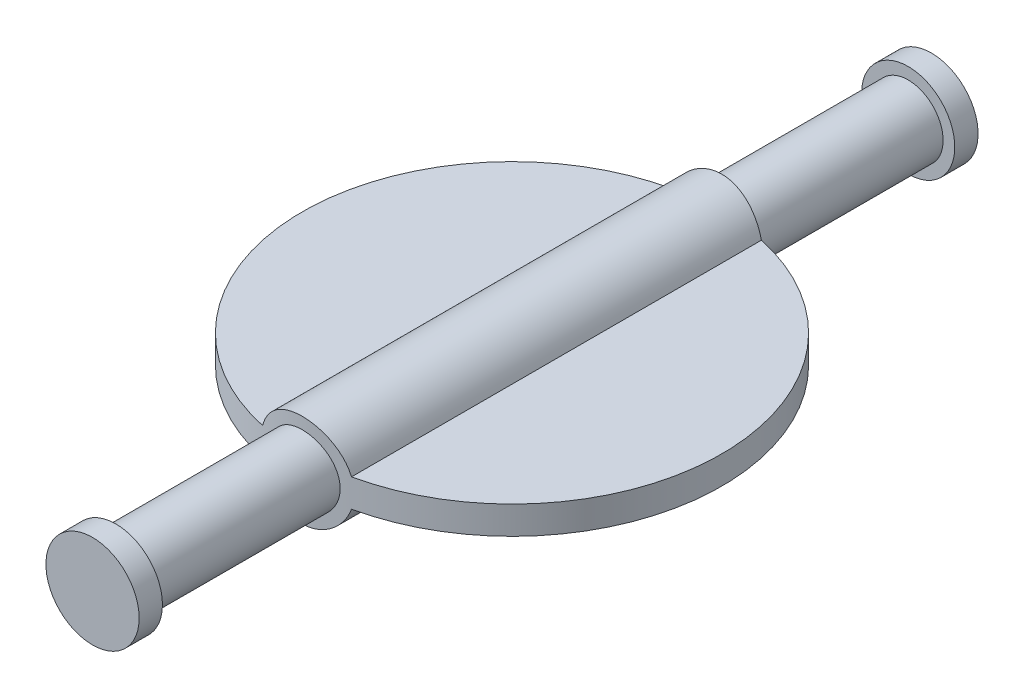
ISO-10303-21;
HEADER;
FILE_DESCRIPTION(('STEP AP214'),'2;1');
FILE_NAME('part.step','',(''),(''),'','','');
FILE_SCHEMA(('AUTOMOTIVE_DESIGN { 1 0 10303 214 1 1 1 1 }'));
ENDSEC;
DATA;
#1=APPLICATION_CONTEXT('core data for automotive mechanical design processes');
#2=APPLICATION_PROTOCOL_DEFINITION('international standard','automotive_design',2000,#1);
#3=PRODUCT_CONTEXT('',#1,'mechanical');
#4=PRODUCT('Part','Part','',(#3));
#5=PRODUCT_RELATED_PRODUCT_CATEGORY('part','',(#4));
#6=PRODUCT_DEFINITION_FORMATION('','',#4);
#7=PRODUCT_DEFINITION_CONTEXT('part definition',#1,'design');
#8=PRODUCT_DEFINITION('design','',#6,#7);
#9=PRODUCT_DEFINITION_SHAPE('','',#8);
#10=(LENGTH_UNIT() NAMED_UNIT(*) SI_UNIT(.MILLI.,.METRE.));
#11=(NAMED_UNIT(*) PLANE_ANGLE_UNIT() SI_UNIT($,.RADIAN.));
#12=(NAMED_UNIT(*) SI_UNIT($,.STERADIAN.) SOLID_ANGLE_UNIT());
#13=UNCERTAINTY_MEASURE_WITH_UNIT(LENGTH_MEASURE(1.E-05),#10,'distance_accuracy_value','');
#14=(GEOMETRIC_REPRESENTATION_CONTEXT(3) GLOBAL_UNCERTAINTY_ASSIGNED_CONTEXT((#13)) GLOBAL_UNIT_ASSIGNED_CONTEXT((#10,
#11,#12)) REPRESENTATION_CONTEXT('',''));
#15=CARTESIAN_POINT('',(0.,0.,0.));
#16=DIRECTION('',(0.,0.,1.));
#17=DIRECTION('',(1.,0.,0.));
#18=AXIS2_PLACEMENT_3D('',#15,#16,#17);
#19=CARTESIAN_POINT('',(0.,0.,36.));
#20=DIRECTION('',(0.,0.,-1.));
#21=DIRECTION('',(-1.,0.,0.));
#22=AXIS2_PLACEMENT_3D('',#19,#20,#21);
#23=CYLINDRICAL_SURFACE('',#22,1.5);
#24=CARTESIAN_POINT('',(0.,0.,35.));
#25=DIRECTION('',(0.,0.,1.));
#26=DIRECTION('',(1.,0.,0.));
#27=AXIS2_PLACEMENT_3D('',#24,#25,#26);
#28=CIRCLE('',#27,1.5);
#29=CARTESIAN_POINT('',(1.5,0.,35.));
#30=VERTEX_POINT('',#29);
#31=EDGE_CURVE('E111',#30,#30,#28,.T.);
#32=ORIENTED_EDGE('',*,*,#31,.F.);
#33=EDGE_LOOP('',(#32));
#34=FACE_BOUND('',#33,.T.);
#35=CARTESIAN_POINT('',(-1.5,0.,26.8741196746494));
#36=CARTESIAN_POINT('',(-1.4999966390526,-0.0836254488876177,26.8741211844077));
#37=CARTESIAN_POINT('',(-1.49298310142239,-0.167296563614922,26.8753145552884));
#38=CARTESIAN_POINT('',(-1.46512645684523,-0.332291125932099,26.8799547442091));
#39=CARTESIAN_POINT('',(-1.44427059618579,-0.413612336249714,26.8834036403486));
#40=CARTESIAN_POINT('',(-1.38937772620028,-0.571495370014066,26.8921536559339));
#41=CARTESIAN_POINT('',(-1.35535173295865,-0.648061109199787,26.8974532270317));
#42=CARTESIAN_POINT('',(-1.27511189813422,-0.794388572828226,26.909305632686));
#43=CARTESIAN_POINT('',(-1.22889942810094,-0.864151061745743,26.9158583261848));
#44=CARTESIAN_POINT('',(-1.12511251617978,-0.9955877098474,26.9295508269157));
#45=CARTESIAN_POINT('',(-1.06744142935936,-1.05718507883191,26.9366953039624));
#46=CARTESIAN_POINT('',(-0.942583202817203,-1.16987598411691,26.9507248840167));
#47=CARTESIAN_POINT('',(-0.875395499489993,-1.2209688978692,26.9576099716318));
#48=CARTESIAN_POINT('',(-0.732913721969003,-1.31148874033161,26.9703944218948));
#49=CARTESIAN_POINT('',(-0.657573648874022,-1.3508442046391,26.9762876545937));
#50=CARTESIAN_POINT('',(-0.501237373034323,-1.41631264231832,26.9863724217429));
#51=CARTESIAN_POINT('',(-0.420241538446913,-1.44242647673092,26.990564066836));
#52=CARTESIAN_POINT('',(-0.255686235806544,-1.48043552099034,26.9967404083463));
#53=CARTESIAN_POINT('',(-0.172157332007562,-1.49245974960282,26.9987451186654));
#54=CARTESIAN_POINT('',(-0.00424517131547821,-1.50234945249156,27.0003904760567));
#55=CARTESIAN_POINT('',(0.0801380271173393,-1.50021588914834,27.0000312838158));
#56=CARTESIAN_POINT('',(0.246481311047326,-1.48195118908307,26.9970051505883));
#57=CARTESIAN_POINT('',(0.328457118420085,-1.46595890195451,26.9943611021544));
#58=CARTESIAN_POINT('',(0.488545187767075,-1.4206493554521,26.9870878726298));
#59=CARTESIAN_POINT('',(0.566657331990903,-1.3913316902463,26.9824586310793));
#60=CARTESIAN_POINT('',(0.717213688669589,-1.32006561581081,26.9716961910717));
#61=CARTESIAN_POINT('',(0.789630313811427,-1.27805999275054,26.9655562039613));
#62=CARTESIAN_POINT('',(0.926439317907985,-1.18265230641897,26.952454428429));
#63=CARTESIAN_POINT('',(0.990831046749526,-1.12924932077351,26.9454925735148));
#64=CARTESIAN_POINT('',(1.110582764068,-1.01179271602842,26.9314216093956));
#65=CARTESIAN_POINT('',(1.16582370135192,-0.94761774305941,26.9243117383863));
#66=CARTESIAN_POINT('',(1.26477275306884,-0.810847745870508,26.9108277587088));
#67=CARTESIAN_POINT('',(1.30848076111945,-0.738252643990308,26.9044536568279));
#68=CARTESIAN_POINT('',(1.38314666069297,-0.586565014873512,26.8931625273709));
#69=CARTESIAN_POINT('',(1.41409021636755,-0.507465301144745,26.8882471398156));
#70=CARTESIAN_POINT('',(1.46221792248937,-0.345090556615473,26.8804571321393));
#71=CARTESIAN_POINT('',(1.47940328446077,-0.261815894140545,26.8775823323299));
#72=CARTESIAN_POINT('',(1.49935913092756,-0.094520306302721,26.8742337565327));
#73=CARTESIAN_POINT('',(1.50229932474746,-0.0105201721787389,26.873731714552));
#74=CARTESIAN_POINT('',(1.49413362160947,0.156772003014492,26.8751102086942));
#75=CARTESIAN_POINT('',(1.4830282671748,0.240064071308383,26.8769906527911));
#76=CARTESIAN_POINT('',(1.44723140095686,0.403036655514515,26.8828961247301));
#77=CARTESIAN_POINT('',(1.42262627438783,0.482736683926807,26.8869075115101));
#78=CARTESIAN_POINT('',(1.36061891411536,0.636882099767692,26.896611438033));
#79=CARTESIAN_POINT('',(1.32321591486056,0.711327172530541,26.9023040783435));
#80=CARTESIAN_POINT('',(1.23627400393754,0.853604756643666,26.9147947703844));
#81=CARTESIAN_POINT('',(1.18662633849562,0.921369943653635,26.9216025336021));
#82=CARTESIAN_POINT('',(1.07675367942479,1.047668119617,26.9355280000792));
#83=CARTESIAN_POINT('',(1.01652794183043,1.10620045866584,26.942645725112));
#84=CARTESIAN_POINT('',(0.886456842197285,1.21299113563722,26.9564785327096));
#85=CARTESIAN_POINT('',(0.816517952031717,1.26113629577073,26.963188658068));
#86=CARTESIAN_POINT('',(0.669446068769595,1.34499319620293,26.9753706745976));
#87=CARTESIAN_POINT('',(0.592313308482376,1.38070533868431,26.9808426058199));
#88=CARTESIAN_POINT('',(0.433379430900796,1.43850635037292,26.9899101490175));
#89=CARTESIAN_POINT('',(0.351600337561566,1.46065444544095,26.9935139074057));
#90=CARTESIAN_POINT('',(0.185418440924527,1.4908893593783,26.9984734990157));
#91=CARTESIAN_POINT('',(0.101015854092974,1.49897733523942,26.9998295172011));
#92=CARTESIAN_POINT('',(-0.0669247654642091,1.50082912938731,27.0001382273269));
#93=CARTESIAN_POINT('',(-0.150460896361608,1.49476515236463,26.9991198121454));
#94=CARTESIAN_POINT('',(-0.315307184588815,1.46885764663836,26.9948530703237));
#95=CARTESIAN_POINT('',(-0.396617354380456,1.44901419509426,26.99160475617));
#96=CARTESIAN_POINT('',(-0.554637867551156,1.39617710067374,26.9832419329655));
#97=CARTESIAN_POINT('',(-0.631353223292414,1.36319809907373,26.9781295022493));
#98=CARTESIAN_POINT('',(-0.77818827178918,1.28504523826189,26.9665965412641));
#99=CARTESIAN_POINT('',(-0.848307651670479,1.23987080096342,26.9601759489893));
#100=CARTESIAN_POINT('',(-0.980827767316296,1.1379989445228,26.9466457777138));
#101=CARTESIAN_POINT('',(-1.04313085836337,1.08117542714587,26.9395291473044));
#102=CARTESIAN_POINT('',(-1.15737832556883,0.957883015261083,26.9254578198285));
#103=CARTESIAN_POINT('',(-1.20932027202071,0.891411864665071,26.9185031610816));
#104=CARTESIAN_POINT('',(-1.30170856255177,0.750152806495416,26.9054900614206));
#105=CARTESIAN_POINT('',(-1.34207099345672,0.67530939609717,26.8994383078874));
#106=CARTESIAN_POINT('',(-1.40958872186455,0.519834458453138,26.8889952613306));
#107=CARTESIAN_POINT('',(-1.43675721313896,0.439208806381864,26.8846023105076));
#108=CARTESIAN_POINT('',(-1.47121563187329,0.298557738313999,26.8789484690267));
#109=CARTESIAN_POINT('',(-1.48199245060217,0.239383915224937,26.8771477405261));
#110=CARTESIAN_POINT('',(-1.49638577710945,0.120147909095334,26.8747328117191));
#111=CARTESIAN_POINT('',(-1.50000241487515,0.0600857422019012,26.8741185898727));
#112=CARTESIAN_POINT('',(-1.5,0.,26.8741196746494));
#113=B_SPLINE_CURVE_WITH_KNOTS('',3,(#35,#36,#37,#38,#39,#40,#41,#42,#43,#44,#45,#46,#47,#48,
#49,#50,#51,#52,#53,#54,#55,#56,#57,#58,#59,#60,#61,#62,#63,#64,#65,#66,#67,#68,#69,#70,#71,#72,
#73,#74,#75,#76,#77,#78,#79,#80,#81,#82,#83,#84,#85,#86,#87,#88,#89,#90,#91,#92,#93,#94,#95,#96,
#97,#98,#99,#100,#101,#102,#103,#104,#105,#106,#107,#108,#109,#110,#111,#112),.UNSPECIFIED.,.T.,
.F.,(4,2,2,2,2,2,2,2,2,2,2,2,2,2,2,2,2,2,2,2,2,2,2,2,2,2,2,2,2,2,2,2,2,2,2,2,2,2,4),(0.,
0.250656623343191,0.501544511951669,0.752222998699,1.00287328440553,1.25573495490817,
1.50861160698057,1.7629978806425,2.01736761064056,2.26938940480928,2.52139406789004,
2.7709027269619,3.02041898547108,3.27107762481044,3.52175655733447,3.77547674074663,
4.02919926445,4.28320597496551,4.53719031560235,4.78814125449635,5.03908250045774,
5.28843638778684,5.53780519373533,5.7894740565501,6.04116062655802,6.29546467818618,
6.54976050283408,6.80293790647976,7.05609447544799,7.30618665756939,7.55627743928683,
7.80609023896863,8.0559148823279,8.3086019847534,8.56134827326476,8.8158823656771,
9.07016140042576,9.25026402322163,9.43036337636995),.UNSPECIFIED.);
#114=CARTESIAN_POINT('',(-1.5,0.,26.8741196746494));
#115=VERTEX_POINT('',#114);
#116=EDGE_CURVE('E43',#115,#115,#113,.T.);
#117=ORIENTED_EDGE('',*,*,#116,.T.);
#118=EDGE_LOOP('',(#117));
#119=FACE_BOUND('',#118,.T.);
#120=ADVANCED_FACE('F34',(#34,#119),#23,.T.);
#121=CARTESIAN_POINT('',(0.,0.6,18.));
#122=DIRECTION('',(0.,-1.,0.));
#123=DIRECTION('',(0.,0.,-1.));
#124=AXIS2_PLACEMENT_3D('',#121,#122,#123);
#125=PLANE('',#124);
#126=DIRECTION('',(0.,0.,-1.));
#127=VECTOR('',#126,1.);
#128=CARTESIAN_POINT('',(1.90787840283389,0.6,36.001));
#129=LINE('',#128,#127);
#130=CARTESIAN_POINT('',(1.90787840283389,0.6,26.7954533709184));
#131=VERTEX_POINT('',#130);
#132=CARTESIAN_POINT('',(1.9078784028339,0.600000000000001,9.20454662908158));
#133=VERTEX_POINT('',#132);
#134=EDGE_CURVE('E71',#131,#133,#129,.T.);
#135=ORIENTED_EDGE('',*,*,#134,.F.);
#136=CARTESIAN_POINT('',(0.,0.6,18.));
#137=DIRECTION('',(0.,-1.,0.));
#138=DIRECTION('',(0.,0.,-1.));
#139=AXIS2_PLACEMENT_3D('',#136,#137,#138);
#140=CIRCLE('',#139,9.);
#141=EDGE_CURVE('E87',#133,#131,#140,.T.);
#142=ORIENTED_EDGE('',*,*,#141,.F.);
#143=EDGE_LOOP('',(#135,#142));
#144=FACE_BOUND('',#143,.T.);
#145=ADVANCED_FACE('F92',(#144),#125,.F.);
#146=CARTESIAN_POINT('',(0.,-0.6,18.));
#147=DIRECTION('',(0.,-1.,0.));
#148=DIRECTION('',(0.,0.,-1.));
#149=AXIS2_PLACEMENT_3D('',#146,#147,#148);
#150=PLANE('',#149);
#151=CARTESIAN_POINT('',(0.,-0.6,18.));
#152=DIRECTION('',(0.,-1.,0.));
#153=DIRECTION('',(0.,0.,-1.));
#154=AXIS2_PLACEMENT_3D('',#151,#152,#153);
#155=CIRCLE('',#154,9.);
#156=CARTESIAN_POINT('',(1.90787840283389,-0.6,9.20454662908159));
#157=VERTEX_POINT('',#156);
#158=CARTESIAN_POINT('',(1.90787840283389,-0.6,26.7954533709184));
#159=VERTEX_POINT('',#158);
#160=EDGE_CURVE('E49',#157,#159,#155,.T.);
#161=ORIENTED_EDGE('',*,*,#160,.T.);
#162=DIRECTION('',(0.,0.,-1.));
#163=VECTOR('',#162,1.);
#164=CARTESIAN_POINT('',(1.90787840283389,-0.6,36.001));
#165=LINE('',#164,#163);
#166=EDGE_CURVE('E52',#159,#157,#165,.T.);
#167=ORIENTED_EDGE('',*,*,#166,.T.);
#168=EDGE_LOOP('',(#161,#167));
#169=FACE_BOUND('',#168,.T.);
#170=ADVANCED_FACE('F150',(#169),#150,.T.);
#171=DIRECTION('',(0.,0.,-1.));
#172=VECTOR('',#171,1.);
#173=CARTESIAN_POINT('',(-1.90787840283389,0.6,36.001));
#174=LINE('',#173,#172);
#175=CARTESIAN_POINT('',(-1.90787840283389,0.6,9.20454662908159));
#176=VERTEX_POINT('',#175);
#177=CARTESIAN_POINT('',(-1.90787840283389,0.6,26.7954533709184));
#178=VERTEX_POINT('',#177);
#179=EDGE_CURVE('E304',#176,#178,#174,.F.);
#180=ORIENTED_EDGE('',*,*,#179,.F.);
#181=EDGE_CURVE('E89',#178,#176,#140,.T.);
#182=ORIENTED_EDGE('',*,*,#181,.F.);
#183=EDGE_LOOP('',(#180,#182));
#184=FACE_BOUND('',#183,.T.);
#185=ADVANCED_FACE('F152',(#184),#125,.F.);
#186=CARTESIAN_POINT('',(-1.90787840283389,-0.6,26.7954533709184));
#187=VERTEX_POINT('',#186);
#188=CARTESIAN_POINT('',(-1.90787840283389,-0.6,9.20454662908159));
#189=VERTEX_POINT('',#188);
#190=EDGE_CURVE('E81',#187,#189,#155,.T.);
#191=ORIENTED_EDGE('',*,*,#190,.T.);
#192=DIRECTION('',(0.,0.,-1.));
#193=VECTOR('',#192,1.);
#194=CARTESIAN_POINT('',(-1.90787840283389,-0.6,36.001));
#195=LINE('',#194,#193);
#196=EDGE_CURVE('E11',#189,#187,#195,.F.);
#197=ORIENTED_EDGE('',*,*,#196,.T.);
#198=EDGE_LOOP('',(#191,#197));
#199=FACE_BOUND('',#198,.T.);
#200=ADVANCED_FACE('F153',(#199),#150,.T.);
#201=CARTESIAN_POINT('',(-1.5,0.,9.12588032535058));
#202=CARTESIAN_POINT('',(-1.4999966390526,0.0836254488876177,9.12587881559234));
#203=CARTESIAN_POINT('',(-1.49298310142239,0.167296563614922,9.1246854447116));
#204=CARTESIAN_POINT('',(-1.46512645684523,0.332291125932099,9.12004525579093));
#205=CARTESIAN_POINT('',(-1.44427059618579,0.413612336249715,9.11659635965143));
#206=CARTESIAN_POINT('',(-1.38937772620028,0.571495370014066,9.10784634406605));
#207=CARTESIAN_POINT('',(-1.35535173295865,0.648061109199787,9.1025467729683));
#208=CARTESIAN_POINT('',(-1.27511189813422,0.794388572828226,9.09069436731397));
#209=CARTESIAN_POINT('',(-1.22889942810094,0.864151061745743,9.08414167381516));
#210=CARTESIAN_POINT('',(-1.12511251617978,0.9955877098474,9.07044917308435));
#211=CARTESIAN_POINT('',(-1.06744142935936,1.05718507883191,9.06330469603759));
#212=CARTESIAN_POINT('',(-0.942583202817203,1.16987598411691,9.04927511598325));
#213=CARTESIAN_POINT('',(-0.875395499489993,1.2209688978692,9.04239002836817));
#214=CARTESIAN_POINT('',(-0.732913721969003,1.31148874033161,9.02960557810518));
#215=CARTESIAN_POINT('',(-0.657573648874022,1.3508442046391,9.02371234540634));
#216=CARTESIAN_POINT('',(-0.501237373034323,1.41631264231832,9.01362757825707));
#217=CARTESIAN_POINT('',(-0.420241538446913,1.44242647673092,9.00943593316395));
#218=CARTESIAN_POINT('',(-0.255686235806545,1.48043552099034,9.00325959165372));
#219=CARTESIAN_POINT('',(-0.172157332007562,1.49245974960282,9.00125488133457));
#220=CARTESIAN_POINT('',(-0.00424517131547831,1.50234945249156,8.99960952394331));
#221=CARTESIAN_POINT('',(0.0801380271173394,1.50021588914834,8.99996871618415));
#222=CARTESIAN_POINT('',(0.246481311047326,1.48195118908307,9.00299484941166));
#223=CARTESIAN_POINT('',(0.328457118420085,1.46595890195451,9.00563889784562));
#224=CARTESIAN_POINT('',(0.488545187767075,1.4206493554521,9.01291212737018));
#225=CARTESIAN_POINT('',(0.566657331990903,1.3913316902463,9.01754136892073));
#226=CARTESIAN_POINT('',(0.717213688669589,1.32006561581081,9.02830380892826));
#227=CARTESIAN_POINT('',(0.789630313811427,1.27805999275054,9.03444379603872));
#228=CARTESIAN_POINT('',(0.926439317907985,1.18265230641897,9.04754557157102));
#229=CARTESIAN_POINT('',(0.990831046749526,1.12924932077351,9.05450742648519));
#230=CARTESIAN_POINT('',(1.110582764068,1.01179271602842,9.06857839060442));
#231=CARTESIAN_POINT('',(1.16582370135193,0.94761774305941,9.07568826161375));
#232=CARTESIAN_POINT('',(1.26477275306884,0.810847745870508,9.08917224129117));
#233=CARTESIAN_POINT('',(1.30848076111945,0.738252643990307,9.09554634317205));
#234=CARTESIAN_POINT('',(1.38314666069297,0.586565014873512,9.1068374726291));
#235=CARTESIAN_POINT('',(1.41409021636755,0.507465301144745,9.11175286018439));
#236=CARTESIAN_POINT('',(1.46221792248937,0.345090556615473,9.11954286786072));
#237=CARTESIAN_POINT('',(1.47940328446077,0.261815894140545,9.12241766767007));
#238=CARTESIAN_POINT('',(1.49935913092756,0.0945203063027207,9.1257662434673));
#239=CARTESIAN_POINT('',(1.50229932474746,0.0105201721787386,9.12626828544799));
#240=CARTESIAN_POINT('',(1.49413362160947,-0.156772003014492,9.12488979130583));
#241=CARTESIAN_POINT('',(1.4830282671748,-0.240064071308384,9.12300934720888));
#242=CARTESIAN_POINT('',(1.44723140095686,-0.403036655514515,9.11710387526989));
#243=CARTESIAN_POINT('',(1.42262627438783,-0.482736683926806,9.11309248848991));
#244=CARTESIAN_POINT('',(1.36061891411537,-0.636882099767692,9.10338856196699));
#245=CARTESIAN_POINT('',(1.32321591486056,-0.711327172530541,9.09769592165653));
#246=CARTESIAN_POINT('',(1.23627400393754,-0.853604756643666,9.08520522961564));
#247=CARTESIAN_POINT('',(1.18662633849562,-0.921369943653635,9.07839746639792));
#248=CARTESIAN_POINT('',(1.07675367942479,-1.047668119617,9.0644719999208));
#249=CARTESIAN_POINT('',(1.01652794183043,-1.10620045866584,9.05735427488801));
#250=CARTESIAN_POINT('',(0.886456842197285,-1.21299113563722,9.04352146729042));
#251=CARTESIAN_POINT('',(0.816517952031717,-1.26113629577073,9.03681134193196));
#252=CARTESIAN_POINT('',(0.669446068769595,-1.34499319620293,9.02462932540235));
#253=CARTESIAN_POINT('',(0.592313308482376,-1.38070533868431,9.01915739418014));
#254=CARTESIAN_POINT('',(0.433379430900796,-1.43850635037292,9.0100898509825));
#255=CARTESIAN_POINT('',(0.351600337561566,-1.46065444544095,9.00648609259427));
#256=CARTESIAN_POINT('',(0.185418440924527,-1.4908893593783,9.00152650098431));
#257=CARTESIAN_POINT('',(0.101015854092974,-1.49897733523942,9.00017048279894));
#258=CARTESIAN_POINT('',(-0.0669247654642087,-1.50082912938731,8.99986177267305));
#259=CARTESIAN_POINT('',(-0.150460896361608,-1.49476515236463,9.00088018785457));
#260=CARTESIAN_POINT('',(-0.315307184588815,-1.46885764663836,9.00514692967631));
#261=CARTESIAN_POINT('',(-0.396617354380455,-1.44901419509426,9.00839524382999));
#262=CARTESIAN_POINT('',(-0.554637867551155,-1.39617710067374,9.01675806703449));
#263=CARTESIAN_POINT('',(-0.631353223292414,-1.36319809907373,9.02187049775067));
#264=CARTESIAN_POINT('',(-0.778188271789179,-1.28504523826189,9.03340345873589));
#265=CARTESIAN_POINT('',(-0.848307651670479,-1.23987080096342,9.03982405101071));
#266=CARTESIAN_POINT('',(-0.980827767316296,-1.1379989445228,9.05335422228617));
#267=CARTESIAN_POINT('',(-1.04313085836337,-1.08117542714587,9.0604708526956));
#268=CARTESIAN_POINT('',(-1.15737832556883,-0.957883015261084,9.07454218017149));
#269=CARTESIAN_POINT('',(-1.20932027202071,-0.891411864665072,9.08149683891838));
#270=CARTESIAN_POINT('',(-1.30170856255177,-0.750152806495417,9.09450993857941));
#271=CARTESIAN_POINT('',(-1.34207099345672,-0.675309396097171,9.10056169211259));
#272=CARTESIAN_POINT('',(-1.40958872186455,-0.519834458453139,9.11100473866938));
#273=CARTESIAN_POINT('',(-1.43675721313896,-0.439208806381864,9.11539768949236));
#274=CARTESIAN_POINT('',(-1.47121563187329,-0.298557738314,9.12105153097332));
#275=CARTESIAN_POINT('',(-1.48199245060217,-0.239383915224937,9.1228522594739));
#276=CARTESIAN_POINT('',(-1.49638577710945,-0.120147909095334,9.12526718828088));
#277=CARTESIAN_POINT('',(-1.50000241487515,-0.0600857422019014,9.12588141012734));
#278=CARTESIAN_POINT('',(-1.5,0.,9.12588032535058));
#279=B_SPLINE_CURVE_WITH_KNOTS('',3,(#201,#202,#203,#204,#205,#206,#207,#208,#209,#210,#211,
#212,#213,#214,#215,#216,#217,#218,#219,#220,#221,#222,#223,#224,#225,#226,#227,#228,#229,#230,
#231,#232,#233,#234,#235,#236,#237,#238,#239,#240,#241,#242,#243,#244,#245,#246,#247,#248,#249,
#250,#251,#252,#253,#254,#255,#256,#257,#258,#259,#260,#261,#262,#263,#264,#265,#266,#267,#268,
#269,#270,#271,#272,#273,#274,#275,#276,#277,#278),.UNSPECIFIED.,.T.,.F.,(4,2,2,2,2,2,2,2,2,2,2,
2,2,2,2,2,2,2,2,2,2,2,2,2,2,2,2,2,2,2,2,2,2,2,2,2,2,2,4),(0.,0.250656623343191,
0.501544511951669,0.752222998699,1.00287328440553,1.25573495490817,1.50861160698057,
1.7629978806425,2.01736761064056,2.26938940480928,2.52139406789004,2.7709027269619,
3.02041898547108,3.27107762481044,3.52175655733447,3.77547674074663,4.02919926445,
4.28320597496551,4.53719031560235,4.78814125449635,5.03908250045774,5.28843638778684,
5.53780519373533,5.7894740565501,6.04116062655802,6.29546467818618,6.54976050283408,
6.80293790647976,7.05609447544799,7.30618665756939,7.55627743928683,7.80609023896863,
8.0559148823279,8.3086019847534,8.56134827326476,8.8158823656771,9.07016140042576,
9.25026402322163,9.43036337636995),.UNSPECIFIED.);
#280=CARTESIAN_POINT('',(-1.5,0.,9.12588032535058));
#281=VERTEX_POINT('',#280);
#282=EDGE_CURVE('E114',#281,#281,#279,.T.);
#283=ORIENTED_EDGE('',*,*,#282,.T.);
#284=EDGE_LOOP('',(#283));
#285=FACE_BOUND('',#284,.T.);
#286=CARTESIAN_POINT('',(0.,0.,1.));
#287=DIRECTION('',(0.,0.,-1.));
#288=DIRECTION('',(-1.,0.,0.));
#289=AXIS2_PLACEMENT_3D('',#286,#287,#288);
#290=CIRCLE('',#289,1.5);
#291=CARTESIAN_POINT('',(-1.5,0.,1.));
#292=VERTEX_POINT('',#291);
#293=EDGE_CURVE('E106',#292,#292,#290,.T.);
#294=ORIENTED_EDGE('',*,*,#293,.F.);
#295=EDGE_LOOP('',(#294));
#296=FACE_BOUND('',#295,.T.);
#297=ADVANCED_FACE('F36',(#285,#296),#23,.T.);
#298=CARTESIAN_POINT('',(0.,0.,1.));
#299=DIRECTION('',(0.,0.,-1.));
#300=DIRECTION('',(-1.,0.,0.));
#301=AXIS2_PLACEMENT_3D('',#298,#299,#300);
#302=CYLINDRICAL_SURFACE('',#301,2.);
#303=CARTESIAN_POINT('',(0.,0.,1.));
#304=DIRECTION('',(0.,0.,-1.));
#305=DIRECTION('',(-1.,0.,0.));
#306=AXIS2_PLACEMENT_3D('',#303,#304,#305);
#307=CIRCLE('',#306,2.);
#308=CARTESIAN_POINT('',(-2.,0.,1.));
#309=VERTEX_POINT('',#308);
#310=EDGE_CURVE('E103',#309,#309,#307,.T.);
#311=ORIENTED_EDGE('',*,*,#310,.T.);
#312=EDGE_LOOP('',(#311));
#313=FACE_BOUND('',#312,.T.);
#314=CARTESIAN_POINT('',(0.,0.,0.));
#315=DIRECTION('',(0.,0.,-1.));
#316=DIRECTION('',(-1.,0.,0.));
#317=AXIS2_PLACEMENT_3D('',#314,#315,#316);
#318=CIRCLE('',#317,2.);
#319=CARTESIAN_POINT('',(-2.,0.,0.));
#320=VERTEX_POINT('',#319);
#321=EDGE_CURVE('E101',#320,#320,#318,.T.);
#322=ORIENTED_EDGE('',*,*,#321,.F.);
#323=EDGE_LOOP('',(#322));
#324=FACE_BOUND('',#323,.T.);
#325=ADVANCED_FACE('F168',(#313,#324),#302,.T.);
#326=CARTESIAN_POINT('',(0.,0.,1.));
#327=DIRECTION('',(0.,0.,-1.));
#328=DIRECTION('',(-1.,0.,0.));
#329=AXIS2_PLACEMENT_3D('',#326,#327,#328);
#330=PLANE('',#329);
#331=ORIENTED_EDGE('',*,*,#293,.T.);
#332=EDGE_LOOP('',(#331));
#333=FACE_BOUND('',#332,.T.);
#334=ORIENTED_EDGE('',*,*,#310,.F.);
#335=EDGE_LOOP('',(#334));
#336=FACE_BOUND('',#335,.T.);
#337=ADVANCED_FACE('F173',(#333,#336),#330,.F.);
#338=CARTESIAN_POINT('',(0.,0.,0.));
#339=DIRECTION('',(0.,0.,1.));
#340=DIRECTION('',(1.,0.,0.));
#341=AXIS2_PLACEMENT_3D('',#338,#339,#340);
#342=PLANE('',#341);
#343=ORIENTED_EDGE('',*,*,#321,.T.);
#344=EDGE_LOOP('',(#343));
#345=FACE_BOUND('',#344,.T.);
#346=ADVANCED_FACE('F182',(#345),#342,.F.);
#347=CARTESIAN_POINT('',(0.,0.,35.));
#348=DIRECTION('',(0.,0.,1.));
#349=DIRECTION('',(1.,0.,0.));
#350=AXIS2_PLACEMENT_3D('',#347,#348,#349);
#351=CYLINDRICAL_SURFACE('',#350,2.);
#352=CARTESIAN_POINT('',(0.,0.,35.));
#353=DIRECTION('',(0.,0.,1.));
#354=DIRECTION('',(1.,0.,0.));
#355=AXIS2_PLACEMENT_3D('',#352,#353,#354);
#356=CIRCLE('',#355,2.);
#357=CARTESIAN_POINT('',(2.,0.,35.));
#358=VERTEX_POINT('',#357);
#359=EDGE_CURVE('E96',#358,#358,#356,.T.);
#360=ORIENTED_EDGE('',*,*,#359,.T.);
#361=EDGE_LOOP('',(#360));
#362=FACE_BOUND('',#361,.T.);
#363=CARTESIAN_POINT('',(0.,0.,36.));
#364=DIRECTION('',(0.,0.,1.));
#365=DIRECTION('',(1.,0.,0.));
#366=AXIS2_PLACEMENT_3D('',#363,#364,#365);
#367=CIRCLE('',#366,2.);
#368=CARTESIAN_POINT('',(2.,0.,36.));
#369=VERTEX_POINT('',#368);
#370=EDGE_CURVE('E93',#369,#369,#367,.T.);
#371=ORIENTED_EDGE('',*,*,#370,.F.);
#372=EDGE_LOOP('',(#371));
#373=FACE_BOUND('',#372,.T.);
#374=ADVANCED_FACE('F189',(#362,#373),#351,.T.);
#375=CARTESIAN_POINT('',(0.,0.,35.));
#376=DIRECTION('',(0.,0.,1.));
#377=DIRECTION('',(1.,0.,0.));
#378=AXIS2_PLACEMENT_3D('',#375,#376,#377);
#379=PLANE('',#378);
#380=ORIENTED_EDGE('',*,*,#31,.T.);
#381=EDGE_LOOP('',(#380));
#382=FACE_BOUND('',#381,.T.);
#383=ORIENTED_EDGE('',*,*,#359,.F.);
#384=EDGE_LOOP('',(#383));
#385=FACE_BOUND('',#384,.T.);
#386=ADVANCED_FACE('F131',(#382,#385),#379,.F.);
#387=CARTESIAN_POINT('',(0.,0.,36.));
#388=DIRECTION('',(0.,0.,1.));
#389=DIRECTION('',(1.,0.,0.));
#390=AXIS2_PLACEMENT_3D('',#387,#388,#389);
#391=PLANE('',#390);
#392=ORIENTED_EDGE('',*,*,#370,.T.);
#393=EDGE_LOOP('',(#392));
#394=FACE_BOUND('',#393,.T.);
#395=ADVANCED_FACE('F128',(#394),#391,.T.);
#396=CARTESIAN_POINT('',(0.,0.6,18.));
#397=DIRECTION('',(0.,-1.,0.));
#398=DIRECTION('',(0.,0.,-1.));
#399=AXIS2_PLACEMENT_3D('',#396,#397,#398);
#400=CYLINDRICAL_SURFACE('',#399,9.);
#401=ORIENTED_EDGE('',*,*,#116,.F.);
#402=EDGE_LOOP('',(#401));
#403=FACE_BOUND('',#402,.T.);
#404=CARTESIAN_POINT('',(2.,0.,9.22503561260788));
#405=CARTESIAN_POINT('',(1.99999624947948,0.11084236771599,9.22503337354267));
#406=CARTESIAN_POINT('',(1.99075413145665,0.221729412658477,9.2229125464016));
#407=CARTESIAN_POINT('',(1.95407223666285,0.44034682608887,9.21467460948588));
#408=CARTESIAN_POINT('',(1.92661957701425,0.54807490341598,9.2085546706227));
#409=CARTESIAN_POINT('',(1.85442638312279,0.757180422269664,9.19304507623236));
#410=CARTESIAN_POINT('',(1.8097051680061,0.8585648140004,9.18365907575408));
#411=CARTESIAN_POINT('',(1.70430003435311,1.05239500705713,9.16267933691781));
#412=CARTESIAN_POINT('',(1.64361633615812,1.14484093174294,9.15108562903498));
#413=CARTESIAN_POINT('',(1.50688107459123,1.31978257136839,9.12677096716624));
#414=CARTESIAN_POINT('',(1.4306036977922,1.40209976211973,9.11403520174097));
#415=CARTESIAN_POINT('',(1.26533367886365,1.55288275243903,9.08900096552841));
#416=CARTESIAN_POINT('',(1.17634002941518,1.62134745364365,9.07670252948063));
#417=CARTESIAN_POINT('',(0.986963945237565,1.74319075139532,9.05376707198274));
#418=CARTESIAN_POINT('',(0.886468216533077,1.79639724945312,9.04314956592566));
#419=CARTESIAN_POINT('',(0.677686335651945,1.88509980172048,9.02493975664515));
#420=CARTESIAN_POINT('',(0.569401088006954,1.92059790847102,9.01734710283825));
#421=CARTESIAN_POINT('',(0.349970796328336,1.97231343293885,9.00614715532747));
#422=CARTESIAN_POINT('',(0.238900228261923,1.9888331092004,9.00247745073067));
#423=CARTESIAN_POINT('',(0.0155076577860236,2.00306827087242,8.99932051047962));
#424=CARTESIAN_POINT('',(-0.0968141954765444,2.00078597393382,8.99983278157056));
#425=CARTESIAN_POINT('',(-0.317435920934346,1.97770627750397,9.00493450648719));
#426=CARTESIAN_POINT('',(-0.425771784327152,1.9572347209089,9.00945220395325));
#427=CARTESIAN_POINT('',(-0.637430845543416,1.89887733244484,9.02197522697695));
#428=CARTESIAN_POINT('',(-0.740753811742809,1.86099069674674,9.02998071351983));
#429=CARTESIAN_POINT('',(-0.940353769390931,1.76859302589905,9.04869461394345));
#430=CARTESIAN_POINT('',(-1.03657202089402,1.71395928345556,9.05942287447207));
#431=CARTESIAN_POINT('',(-1.21859313654481,1.589709906051,9.08240728315983));
#432=CARTESIAN_POINT('',(-1.30439453662954,1.52009216893003,9.0946636456004));
#433=CARTESIAN_POINT('',(-1.46508498958083,1.36607980614704,9.11966834273174));
#434=CARTESIAN_POINT('',(-1.53970021847621,1.28140002402915,9.13242159039862));
#435=CARTESIAN_POINT('',(-1.67372303020546,1.10059725238292,9.15673678558167));
#436=CARTESIAN_POINT('',(-1.73313017348813,1.00447393222571,9.16829869865958));
#437=CARTESIAN_POINT('',(-1.83517765915972,0.803060111651326,9.18893566434911));
#438=CARTESIAN_POINT('',(-1.8777647744073,0.697741777195334,9.1980027951704));
#439=CARTESIAN_POINT('',(-1.94455269523168,0.481193828717716,9.21251485909636));
#440=CARTESIAN_POINT('',(-1.96875652170475,0.369965189142673,9.21796038731486));
#441=CARTESIAN_POINT('',(-1.99766298900203,0.147260012940269,9.22449091505372));
#442=CARTESIAN_POINT('',(-2.00276498767797,0.0358378689601326,9.22566519749141));
#443=CARTESIAN_POINT('',(-1.99440547424347,-0.186264922962566,9.22376135474508));
#444=CARTESIAN_POINT('',(-1.98094528187579,-0.29694562305844,9.22068353187907));
#445=CARTESIAN_POINT('',(-1.93619037322696,-0.513023537496585,9.21070671724874));
#446=CARTESIAN_POINT('',(-1.90511692654434,-0.618468975296294,9.20385516330968));
#447=CARTESIAN_POINT('',(-1.82625775138724,-0.822656631128681,9.18714591494153));
#448=CARTESIAN_POINT('',(-1.77847038110013,-0.921398189499457,9.17728792520173));
#449=CARTESIAN_POINT('',(-1.66666470166548,-1.11109960177642,9.15548125948353));
#450=CARTESIAN_POINT('',(-1.60240114470844,-1.20191131498507,9.14350192356022));
#451=CARTESIAN_POINT('',(-1.45978704293772,-1.37160835740869,9.11888257986813));
#452=CARTESIAN_POINT('',(-1.38143468953093,-1.45049215302858,9.1062424874253));
#453=CARTESIAN_POINT('',(-1.21105721461462,-1.59565134350859,9.08143066072752));
#454=CARTESIAN_POINT('',(-1.11879740983627,-1.66165403586946,9.06927267268488));
#455=CARTESIAN_POINT('',(-0.924268162142588,-1.77722413423402,9.04705088556557));
#456=CARTESIAN_POINT('',(-0.821999194813062,-1.82679232063344,9.03698698705911));
#457=CARTESIAN_POINT('',(-0.611001900003296,-1.90771011463341,9.02014511280418));
#458=CARTESIAN_POINT('',(-0.502320388174407,-1.93917719589416,9.0133459978141));
#459=CARTESIAN_POINT('',(-0.281045086795591,-1.98336516001653,9.00370823300488));
#460=CARTESIAN_POINT('',(-0.168451887925187,-1.99608886071384,9.00086898787163));
#461=CARTESIAN_POINT('',(0.0548648455403722,-2.00229878236896,8.9994892479972));
#462=CARTESIAN_POINT('',(0.165576705736198,-1.99619163065926,9.00085788769511));
#463=CARTESIAN_POINT('',(0.384354041366151,-1.96582504944325,9.0075447353688));
#464=CARTESIAN_POINT('',(0.492419567343289,-1.94156596690497,9.01286286785134));
#465=CARTESIAN_POINT('',(0.702510284786642,-1.87578164280529,9.02684362935553));
#466=CARTESIAN_POINT('',(0.804554882640544,-1.83431577609928,9.0354947500738));
#467=CARTESIAN_POINT('',(1.00029152809303,-1.73535219646055,9.0552191268219));
#468=CARTESIAN_POINT('',(1.0939827357907,-1.67785287381978,9.06629262602677));
#469=CARTESIAN_POINT('',(1.27233089950998,-1.54713772253693,9.08992517384464));
#470=CARTESIAN_POINT('',(1.35677575839294,-1.47363696431056,9.10250900513707));
#471=CARTESIAN_POINT('',(1.51227173235308,-1.31357786354765,9.12761292822313));
#472=CARTESIAN_POINT('',(1.58331959999146,-1.22701636420991,9.14013300384856));
#473=CARTESIAN_POINT('',(1.71095851141984,-1.04184550021205,9.16388629833522));
#474=CARTESIAN_POINT('',(1.76733485857975,-0.943085383259317,9.17509920893149));
#475=CARTESIAN_POINT('',(1.86260026324667,-0.737263104628834,9.19471159813509));
#476=CARTESIAN_POINT('',(1.90150390773299,-0.630207955894346,9.20311342206068));
#477=CARTESIAN_POINT('',(1.95389349465735,-0.435893525944749,9.21462378259595));
#478=CARTESIAN_POINT('',(1.97114982047985,-0.349676572726513,9.21850195485604));
#479=CARTESIAN_POINT('',(1.99420426170609,-0.175649043419826,9.22370869084854));
#480=CARTESIAN_POINT('',(2.00000297215128,-0.0878385503295456,9.22503738698573));
#481=CARTESIAN_POINT('',(2.,0.,9.22503561260788));
#482=B_SPLINE_CURVE_WITH_KNOTS('',3,(#404,#405,#406,#407,#408,#409,#410,#411,#412,#413,#414,
#415,#416,#417,#418,#419,#420,#421,#422,#423,#424,#425,#426,#427,#428,#429,#430,#431,#432,#433,
#434,#435,#436,#437,#438,#439,#440,#441,#442,#443,#444,#445,#446,#447,#448,#449,#450,#451,#452,
#453,#454,#455,#456,#457,#458,#459,#460,#461,#462,#463,#464,#465,#466,#467,#468,#469,#470,#471,
#472,#473,#474,#475,#476,#477,#478,#479,#480,#481),.UNSPECIFIED.,.T.,.F.,(4,2,2,2,2,2,2,2,2,2,2,
2,2,2,2,2,2,2,2,2,2,2,2,2,2,2,2,2,2,2,2,2,2,2,2,2,2,2,4),(0.,0.332205117020653,
0.664645500445895,0.99671504007781,1.32877999616248,1.66604593919643,2.00333861356301,
2.34429812642809,2.68521811023267,3.02062971478989,3.35600175886082,3.68548441840912,
4.0149822874403,4.34695458006495,4.67897347670087,5.01812047297981,5.35727727033735,
5.69749889450325,6.0376645984937,6.37067749516634,6.70366671636337,7.03256257950694,
7.3614907592462,7.69563228727099,8.02981674004574,8.37045046043533,8.71106800344854,
9.04944929455635,9.38777970902404,9.7188558756526,10.0499257140336,10.3798625177934,
10.7098324580937,11.0462446945479,11.3827383729968,11.7239097153546,12.0647957010371,
12.3280698629932,12.5913303516713),.UNSPECIFIED.);
#483=EDGE_CURVE('E74',#133,#176,#482,.T.);
#484=ORIENTED_EDGE('',*,*,#483,.F.);
#485=ORIENTED_EDGE('',*,*,#141,.T.);
#486=CARTESIAN_POINT('',(-2.,0.,26.7749643873921));
#487=CARTESIAN_POINT('',(-1.99999624947948,-0.11084236771599,26.7749666264573));
#488=CARTESIAN_POINT('',(-1.99075413145665,-0.221729412658477,26.7770874535984));
#489=CARTESIAN_POINT('',(-1.95407223666285,-0.44034682608887,26.7853253905141));
#490=CARTESIAN_POINT('',(-1.92661957701425,-0.54807490341598,26.7914453293773));
#491=CARTESIAN_POINT('',(-1.85442638312279,-0.757180422269664,26.8069549237676));
#492=CARTESIAN_POINT('',(-1.8097051680061,-0.858564814000399,26.8163409242459));
#493=CARTESIAN_POINT('',(-1.70430003435311,-1.05239500705713,26.8373206630822));
#494=CARTESIAN_POINT('',(-1.64361633615812,-1.14484093174294,26.848914370965));
#495=CARTESIAN_POINT('',(-1.50688107459123,-1.31978257136839,26.8732290328338));
#496=CARTESIAN_POINT('',(-1.4306036977922,-1.40209976211973,26.885964798259));
#497=CARTESIAN_POINT('',(-1.26533367886365,-1.55288275243903,26.9109990344716));
#498=CARTESIAN_POINT('',(-1.17634002941518,-1.62134745364365,26.9232974705194));
#499=CARTESIAN_POINT('',(-0.986963945237565,-1.74319075139532,26.9462329280173));
#500=CARTESIAN_POINT('',(-0.886468216533077,-1.79639724945312,26.9568504340743));
#501=CARTESIAN_POINT('',(-0.677686335651945,-1.88509980172048,26.9750602433549));
#502=CARTESIAN_POINT('',(-0.569401088006954,-1.92059790847101,26.9826528971617));
#503=CARTESIAN_POINT('',(-0.349970796328337,-1.97231343293885,26.9938528446725));
#504=CARTESIAN_POINT('',(-0.238900228261923,-1.9888331092004,26.9975225492693));
#505=CARTESIAN_POINT('',(-0.0155076577860245,-2.00306827087242,27.0006794895204));
#506=CARTESIAN_POINT('',(0.0968141954765438,-2.00078597393382,27.0001672184294));
#507=CARTESIAN_POINT('',(0.317435920934346,-1.97770627750397,26.9950654935128));
#508=CARTESIAN_POINT('',(0.425771784327151,-1.9572347209089,26.9905477960467));
#509=CARTESIAN_POINT('',(0.637430845543415,-1.89887733244484,26.978024773023));
#510=CARTESIAN_POINT('',(0.740753811742808,-1.86099069674675,26.9700192864802));
#511=CARTESIAN_POINT('',(0.940353769390931,-1.76859302589905,26.9513053860566));
#512=CARTESIAN_POINT('',(1.03657202089402,-1.71395928345556,26.9405771255279));
#513=CARTESIAN_POINT('',(1.21859313654481,-1.589709906051,26.9175927168402));
#514=CARTESIAN_POINT('',(1.30439453662954,-1.52009216893004,26.9053363543996));
#515=CARTESIAN_POINT('',(1.46508498958083,-1.36607980614704,26.8803316572683));
#516=CARTESIAN_POINT('',(1.53970021847621,-1.28140002402915,26.8675784096014));
#517=CARTESIAN_POINT('',(1.67372303020546,-1.10059725238292,26.8432632144183));
#518=CARTESIAN_POINT('',(1.73313017348813,-1.00447393222571,26.8317013013404));
#519=CARTESIAN_POINT('',(1.83517765915972,-0.803060111651327,26.8110643356509));
#520=CARTESIAN_POINT('',(1.8777647744073,-0.697741777195334,26.8019972048296));
#521=CARTESIAN_POINT('',(1.94455269523168,-0.481193828717717,26.7874851409036));
#522=CARTESIAN_POINT('',(1.96875652170475,-0.369965189142673,26.7820396126851));
#523=CARTESIAN_POINT('',(1.99766298900203,-0.14726001294027,26.7755090849463));
#524=CARTESIAN_POINT('',(2.00276498767797,-0.0358378689601339,26.7743348025086));
#525=CARTESIAN_POINT('',(1.99440547424347,0.186264922962565,26.7762386452549));
#526=CARTESIAN_POINT('',(1.98094528187579,0.296945623058438,26.7793164681209));
#527=CARTESIAN_POINT('',(1.93619037322696,0.513023537496584,26.7892932827513));
#528=CARTESIAN_POINT('',(1.90511692654434,0.618468975296293,26.7961448366903));
#529=CARTESIAN_POINT('',(1.82625775138724,0.82265663112868,26.8128540850585));
#530=CARTESIAN_POINT('',(1.77847038110013,0.921398189499456,26.8227120747983));
#531=CARTESIAN_POINT('',(1.66666470166548,1.11109960177642,26.8445187405165));
#532=CARTESIAN_POINT('',(1.60240114470844,1.20191131498507,26.8564980764398));
#533=CARTESIAN_POINT('',(1.45978704293772,1.37160835740869,26.8811174201319));
#534=CARTESIAN_POINT('',(1.38143468953094,1.45049215302858,26.8937575125747));
#535=CARTESIAN_POINT('',(1.21105721461462,1.59565134350859,26.9185693392725));
#536=CARTESIAN_POINT('',(1.11879740983628,1.66165403586946,26.9307273273151));
#537=CARTESIAN_POINT('',(0.924268162142589,1.77722413423402,26.9529491144344));
#538=CARTESIAN_POINT('',(0.821999194813063,1.82679232063344,26.9630130129409));
#539=CARTESIAN_POINT('',(0.611001900003297,1.90771011463341,26.9798548871958));
#540=CARTESIAN_POINT('',(0.502320388174408,1.93917719589416,26.9866540021859));
#541=CARTESIAN_POINT('',(0.281045086795591,1.98336516001653,26.9962917669951));
#542=CARTESIAN_POINT('',(0.168451887925188,1.99608886071384,26.9991310121284));
#543=CARTESIAN_POINT('',(-0.0548648455403706,2.00229878236896,27.0005107520028));
#544=CARTESIAN_POINT('',(-0.165576705736196,1.99619163065926,26.9991421123049));
#545=CARTESIAN_POINT('',(-0.384354041366149,1.96582504944325,26.9924552646312));
#546=CARTESIAN_POINT('',(-0.492419567343288,1.94156596690497,26.9871371321487));
#547=CARTESIAN_POINT('',(-0.70251028478664,1.87578164280529,26.9731563706445));
#548=CARTESIAN_POINT('',(-0.804554882640542,1.83431577609929,26.9645052499262));
#549=CARTESIAN_POINT('',(-1.00029152809303,1.73535219646055,26.9447808731781));
#550=CARTESIAN_POINT('',(-1.0939827357907,1.67785287381978,26.9337073739732));
#551=CARTESIAN_POINT('',(-1.27233089950998,1.54713772253693,26.9100748261554));
#552=CARTESIAN_POINT('',(-1.35677575839294,1.47363696431056,26.8974909948629));
#553=CARTESIAN_POINT('',(-1.51227173235308,1.31357786354765,26.8723870717769));
#554=CARTESIAN_POINT('',(-1.58331959999146,1.22701636420991,26.8598669961514));
#555=CARTESIAN_POINT('',(-1.71095851141984,1.04184550021205,26.8361137016648));
#556=CARTESIAN_POINT('',(-1.76733485857975,0.943085383259317,26.8249007910685));
#557=CARTESIAN_POINT('',(-1.86260026324667,0.737263104628835,26.8052884018649));
#558=CARTESIAN_POINT('',(-1.90150390773299,0.630207955894347,26.7968865779393));
#559=CARTESIAN_POINT('',(-1.95389349465735,0.43589352594475,26.785376217404));
#560=CARTESIAN_POINT('',(-1.97114982047985,0.349676572726514,26.781498045144));
#561=CARTESIAN_POINT('',(-1.99420426170609,0.175649043419827,26.7762913091515));
#562=CARTESIAN_POINT('',(-2.00000297215128,0.0878385503295461,26.7749626130143));
#563=CARTESIAN_POINT('',(-2.,0.,26.7749643873921));
#564=B_SPLINE_CURVE_WITH_KNOTS('',3,(#486,#487,#488,#489,#490,#491,#492,#493,#494,#495,#496,
#497,#498,#499,#500,#501,#502,#503,#504,#505,#506,#507,#508,#509,#510,#511,#512,#513,#514,#515,
#516,#517,#518,#519,#520,#521,#522,#523,#524,#525,#526,#527,#528,#529,#530,#531,#532,#533,#534,
#535,#536,#537,#538,#539,#540,#541,#542,#543,#544,#545,#546,#547,#548,#549,#550,#551,#552,#553,
#554,#555,#556,#557,#558,#559,#560,#561,#562,#563),.UNSPECIFIED.,.T.,.F.,(4,2,2,2,2,2,2,2,2,2,2,
2,2,2,2,2,2,2,2,2,2,2,2,2,2,2,2,2,2,2,2,2,2,2,2,2,2,2,4),(0.,0.332205117020653,
0.664645500445895,0.996715040077809,1.32877999616248,1.66604593919643,2.00333861356301,
2.34429812642809,2.68521811023267,3.02062971478989,3.35600175886081,3.68548441840912,
4.0149822874403,4.34695458006495,4.67897347670087,5.01812047297981,5.35727727033735,
5.69749889450325,6.0376645984937,6.37067749516634,6.70366671636337,7.03256257950694,
7.3614907592462,7.69563228727099,8.02981674004573,8.37045046043533,8.71106800344854,
9.04944929455634,9.38777970902403,9.71885587565259,10.0499257140336,10.3798625177933,
10.7098324580937,11.0462446945479,11.3827383729968,11.7239097153546,12.0647957010371,
12.3280698629932,12.5913303516713),.UNSPECIFIED.);
#565=EDGE_CURVE('E77',#131,#178,#564,.T.);
#566=ORIENTED_EDGE('',*,*,#565,.T.);
#567=ORIENTED_EDGE('',*,*,#181,.T.);
#568=EDGE_LOOP('',(#484,#485,#566,#567));
#569=FACE_BOUND('',#568,.T.);
#570=ORIENTED_EDGE('',*,*,#282,.F.);
#571=EDGE_LOOP('',(#570));
#572=FACE_BOUND('',#571,.T.);
#573=EDGE_CURVE('E137',#187,#159,#564,.T.);
#574=ORIENTED_EDGE('',*,*,#573,.T.);
#575=ORIENTED_EDGE('',*,*,#160,.F.);
#576=EDGE_CURVE('E90',#189,#157,#482,.T.);
#577=ORIENTED_EDGE('',*,*,#576,.F.);
#578=ORIENTED_EDGE('',*,*,#190,.F.);
#579=EDGE_LOOP('',(#574,#575,#577,#578));
#580=FACE_BOUND('',#579,.T.);
#581=ADVANCED_FACE('F85',(#403,#569,#572,#580),#400,.T.);
#582=CARTESIAN_POINT('',(0.,0.,36.001));
#583=DIRECTION('',(0.,0.,-1.));
#584=DIRECTION('',(-1.,0.,0.));
#585=AXIS2_PLACEMENT_3D('',#582,#583,#584);
#586=CYLINDRICAL_SURFACE('',#585,2.);
#587=ORIENTED_EDGE('',*,*,#166,.F.);
#588=ORIENTED_EDGE('',*,*,#573,.F.);
#589=ORIENTED_EDGE('',*,*,#196,.F.);
#590=ORIENTED_EDGE('',*,*,#576,.T.);
#591=EDGE_LOOP('',(#587,#588,#589,#590));
#592=FACE_BOUND('',#591,.T.);
#593=ADVANCED_FACE('F127',(#592),#586,.T.);
#594=ORIENTED_EDGE('',*,*,#565,.F.);
#595=ORIENTED_EDGE('',*,*,#134,.T.);
#596=ORIENTED_EDGE('',*,*,#483,.T.);
#597=ORIENTED_EDGE('',*,*,#179,.T.);
#598=EDGE_LOOP('',(#594,#595,#596,#597));
#599=FACE_BOUND('',#598,.T.);
#600=ADVANCED_FACE('F73',(#599),#586,.T.);
#601=CLOSED_SHELL('',(#120,#145,#170,#185,#200,#297,#325,#337,#346,#374,#386,#395,#581,#593,#600));
#602=MANIFOLD_SOLID_BREP('B2',#601);
#603=ADVANCED_BREP_SHAPE_REPRESENTATION('',(#18,#602),#14);
#604=SHAPE_DEFINITION_REPRESENTATION(#9,#603);
ENDSEC;
END-ISO-10303-21;
